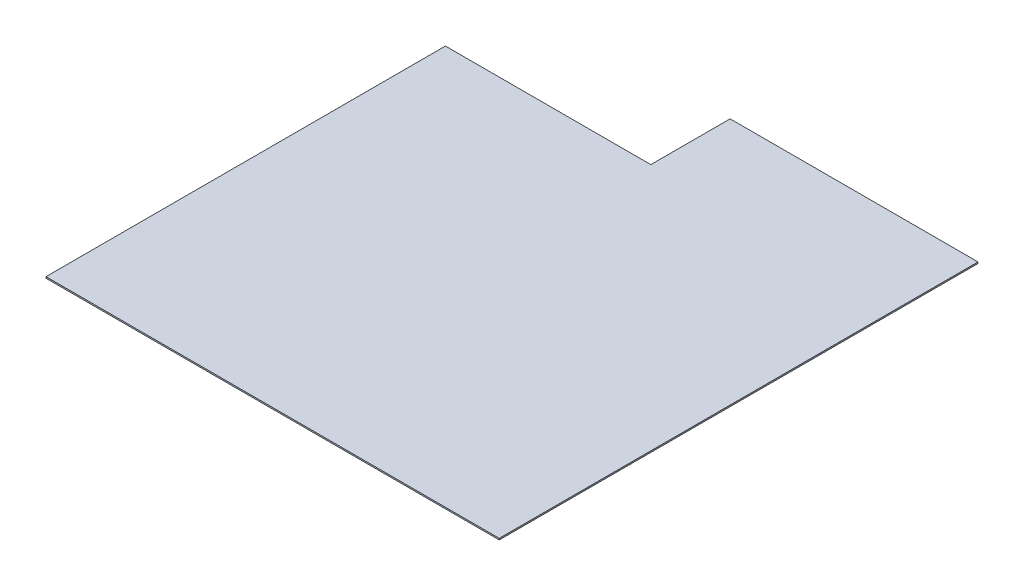
ISO-10303-21;
HEADER;
FILE_DESCRIPTION(('STEP AP214'),'2;1');
FILE_NAME('part.step','',(''),(''),'','','');
FILE_SCHEMA(('AUTOMOTIVE_DESIGN { 1 0 10303 214 1 1 1 1 }'));
ENDSEC;
DATA;
#1=APPLICATION_CONTEXT('core data for automotive mechanical design processes');
#2=APPLICATION_PROTOCOL_DEFINITION('international standard','automotive_design',2000,#1);
#3=PRODUCT_CONTEXT('',#1,'mechanical');
#4=PRODUCT('Part','Part','',(#3));
#5=PRODUCT_RELATED_PRODUCT_CATEGORY('part','',(#4));
#6=PRODUCT_DEFINITION_FORMATION('','',#4);
#7=PRODUCT_DEFINITION_CONTEXT('part definition',#1,'design');
#8=PRODUCT_DEFINITION('design','',#6,#7);
#9=PRODUCT_DEFINITION_SHAPE('','',#8);
#10=(LENGTH_UNIT() NAMED_UNIT(*) SI_UNIT(.MILLI.,.METRE.));
#11=(NAMED_UNIT(*) PLANE_ANGLE_UNIT() SI_UNIT($,.RADIAN.));
#12=(NAMED_UNIT(*) SI_UNIT($,.STERADIAN.) SOLID_ANGLE_UNIT());
#13=UNCERTAINTY_MEASURE_WITH_UNIT(LENGTH_MEASURE(1.E-05),#10,'distance_accuracy_value','');
#14=(GEOMETRIC_REPRESENTATION_CONTEXT(3) GLOBAL_UNCERTAINTY_ASSIGNED_CONTEXT((#13)) GLOBAL_UNIT_ASSIGNED_CONTEXT((#10,
#11,#12)) REPRESENTATION_CONTEXT('',''));
#15=CARTESIAN_POINT('',(0.,0.,0.));
#16=DIRECTION('',(0.,0.,1.));
#17=DIRECTION('',(1.,0.,0.));
#18=AXIS2_PLACEMENT_3D('',#15,#16,#17);
#19=CARTESIAN_POINT('',(-1016.,3.175,0.));
#20=DIRECTION('',(0.,0.,-1.));
#21=DIRECTION('',(-1.,0.,0.));
#22=AXIS2_PLACEMENT_3D('',#19,#20,#21);
#23=PLANE('',#22);
#24=DIRECTION('',(1.,0.,0.));
#25=VECTOR('',#24,1.);
#26=CARTESIAN_POINT('',(-1016.,0.,0.));
#27=LINE('',#26,#25);
#28=CARTESIAN_POINT('',(-1016.,0.,0.));
#29=VERTEX_POINT('',#28);
#30=CARTESIAN_POINT('',(0.,0.,0.));
#31=VERTEX_POINT('',#30);
#32=EDGE_CURVE('E116',#29,#31,#27,.T.);
#33=ORIENTED_EDGE('',*,*,#32,.T.);
#34=DIRECTION('',(0.,-1.,0.));
#35=VECTOR('',#34,1.);
#36=CARTESIAN_POINT('',(0.,3.175,0.));
#37=LINE('',#36,#35);
#38=CARTESIAN_POINT('',(0.,3.175,0.));
#39=VERTEX_POINT('',#38);
#40=EDGE_CURVE('E11',#39,#31,#37,.T.);
#41=ORIENTED_EDGE('',*,*,#40,.F.);
#42=DIRECTION('',(1.,0.,0.));
#43=VECTOR('',#42,1.);
#44=CARTESIAN_POINT('',(-1016.,3.175,0.));
#45=LINE('',#44,#43);
#46=CARTESIAN_POINT('',(-1016.,3.175,0.));
#47=VERTEX_POINT('',#46);
#48=EDGE_CURVE('E126',#47,#39,#45,.T.);
#49=ORIENTED_EDGE('',*,*,#48,.F.);
#50=DIRECTION('',(0.,-1.,0.));
#51=VECTOR('',#50,1.);
#52=CARTESIAN_POINT('',(-1016.,3.175,0.));
#53=LINE('',#52,#51);
#54=EDGE_CURVE('E112',#47,#29,#53,.T.);
#55=ORIENTED_EDGE('',*,*,#54,.T.);
#56=EDGE_LOOP('',(#33,#41,#49,#55));
#57=FACE_BOUND('',#56,.T.);
#58=ADVANCED_FACE('F32',(#57),#23,.F.);
#59=CARTESIAN_POINT('',(0.,3.175,0.));
#60=DIRECTION('',(-1.,0.,0.));
#61=DIRECTION('',(0.,0.,1.));
#62=AXIS2_PLACEMENT_3D('',#59,#60,#61);
#63=PLANE('',#62);
#64=DIRECTION('',(0.,0.,-1.));
#65=VECTOR('',#64,1.);
#66=CARTESIAN_POINT('',(0.,0.,0.));
#67=LINE('',#66,#65);
#68=CARTESIAN_POINT('',(0.,0.,-1073.15));
#69=VERTEX_POINT('',#68);
#70=EDGE_CURVE('E119',#31,#69,#67,.T.);
#71=ORIENTED_EDGE('',*,*,#70,.T.);
#72=DIRECTION('',(0.,-1.,0.));
#73=VECTOR('',#72,1.);
#74=CARTESIAN_POINT('',(0.,3.175,-1073.15));
#75=LINE('',#74,#73);
#76=CARTESIAN_POINT('',(0.,3.175,-1073.15));
#77=VERTEX_POINT('',#76);
#78=EDGE_CURVE('E40',#77,#69,#75,.T.);
#79=ORIENTED_EDGE('',*,*,#78,.F.);
#80=DIRECTION('',(0.,0.,-1.));
#81=VECTOR('',#80,1.);
#82=CARTESIAN_POINT('',(0.,3.175,0.));
#83=LINE('',#82,#81);
#84=EDGE_CURVE('E85',#39,#77,#83,.T.);
#85=ORIENTED_EDGE('',*,*,#84,.F.);
#86=ORIENTED_EDGE('',*,*,#40,.T.);
#87=EDGE_LOOP('',(#71,#79,#85,#86));
#88=FACE_BOUND('',#87,.T.);
#89=ADVANCED_FACE('F150',(#88),#63,.F.);
#90=CARTESIAN_POINT('',(0.,3.175,-1073.15));
#91=DIRECTION('',(0.,0.,1.));
#92=DIRECTION('',(1.,0.,0.));
#93=AXIS2_PLACEMENT_3D('',#90,#91,#92);
#94=PLANE('',#93);
#95=DIRECTION('',(-1.,0.,0.));
#96=VECTOR('',#95,1.);
#97=CARTESIAN_POINT('',(0.,0.,-1073.15));
#98=LINE('',#97,#96);
#99=CARTESIAN_POINT('',(-555.625,0.,-1073.15));
#100=VERTEX_POINT('',#99);
#101=EDGE_CURVE('E121',#69,#100,#98,.T.);
#102=ORIENTED_EDGE('',*,*,#101,.T.);
#103=DIRECTION('',(0.,-1.,0.));
#104=VECTOR('',#103,1.);
#105=CARTESIAN_POINT('',(-555.625,3.175,-1073.15));
#106=LINE('',#105,#104);
#107=CARTESIAN_POINT('',(-555.625,3.175,-1073.15));
#108=VERTEX_POINT('',#107);
#109=EDGE_CURVE('E107',#108,#100,#106,.T.);
#110=ORIENTED_EDGE('',*,*,#109,.F.);
#111=DIRECTION('',(-1.,0.,0.));
#112=VECTOR('',#111,1.);
#113=CARTESIAN_POINT('',(0.,3.175,-1073.15));
#114=LINE('',#113,#112);
#115=EDGE_CURVE('E98',#77,#108,#114,.T.);
#116=ORIENTED_EDGE('',*,*,#115,.F.);
#117=ORIENTED_EDGE('',*,*,#78,.T.);
#118=EDGE_LOOP('',(#102,#110,#116,#117));
#119=FACE_BOUND('',#118,.T.);
#120=ADVANCED_FACE('F132',(#119),#94,.F.);
#121=CARTESIAN_POINT('',(-555.625,3.175,-1073.15));
#122=DIRECTION('',(1.,0.,0.));
#123=DIRECTION('',(0.,0.,-1.));
#124=AXIS2_PLACEMENT_3D('',#121,#122,#123);
#125=PLANE('',#124);
#126=DIRECTION('',(0.,0.,1.));
#127=VECTOR('',#126,1.);
#128=CARTESIAN_POINT('',(-555.625,0.,-1073.15));
#129=LINE('',#128,#127);
#130=CARTESIAN_POINT('',(-555.625,0.,-895.35));
#131=VERTEX_POINT('',#130);
#132=EDGE_CURVE('E106',#100,#131,#129,.T.);
#133=ORIENTED_EDGE('',*,*,#132,.T.);
#134=DIRECTION('',(0.,-1.,0.));
#135=VECTOR('',#134,1.);
#136=CARTESIAN_POINT('',(-555.625,3.175,-895.35));
#137=LINE('',#136,#135);
#138=CARTESIAN_POINT('',(-555.625,3.175,-895.35));
#139=VERTEX_POINT('',#138);
#140=EDGE_CURVE('E103',#139,#131,#137,.T.);
#141=ORIENTED_EDGE('',*,*,#140,.F.);
#142=DIRECTION('',(0.,0.,1.));
#143=VECTOR('',#142,1.);
#144=CARTESIAN_POINT('',(-555.625,3.175,-1073.15));
#145=LINE('',#144,#143);
#146=EDGE_CURVE('E92',#108,#139,#145,.T.);
#147=ORIENTED_EDGE('',*,*,#146,.F.);
#148=ORIENTED_EDGE('',*,*,#109,.T.);
#149=EDGE_LOOP('',(#133,#141,#147,#148));
#150=FACE_BOUND('',#149,.T.);
#151=ADVANCED_FACE('F104',(#150),#125,.F.);
#152=CARTESIAN_POINT('',(-555.625,3.175,-895.35));
#153=DIRECTION('',(0.,0.,1.));
#154=DIRECTION('',(1.,0.,0.));
#155=AXIS2_PLACEMENT_3D('',#152,#153,#154);
#156=PLANE('',#155);
#157=DIRECTION('',(-1.,0.,0.));
#158=VECTOR('',#157,1.);
#159=CARTESIAN_POINT('',(-555.625,0.,-895.35));
#160=LINE('',#159,#158);
#161=CARTESIAN_POINT('',(-1016.,0.,-895.35));
#162=VERTEX_POINT('',#161);
#163=EDGE_CURVE('E71',#131,#162,#160,.T.);
#164=ORIENTED_EDGE('',*,*,#163,.T.);
#165=DIRECTION('',(0.,-1.,0.));
#166=VECTOR('',#165,1.);
#167=CARTESIAN_POINT('',(-1016.,3.175,-895.35));
#168=LINE('',#167,#166);
#169=CARTESIAN_POINT('',(-1016.,3.175,-895.35));
#170=VERTEX_POINT('',#169);
#171=EDGE_CURVE('E108',#170,#162,#168,.T.);
#172=ORIENTED_EDGE('',*,*,#171,.F.);
#173=DIRECTION('',(-1.,0.,0.));
#174=VECTOR('',#173,1.);
#175=CARTESIAN_POINT('',(-555.625,3.175,-895.35));
#176=LINE('',#175,#174);
#177=EDGE_CURVE('E96',#139,#170,#176,.T.);
#178=ORIENTED_EDGE('',*,*,#177,.F.);
#179=ORIENTED_EDGE('',*,*,#140,.T.);
#180=EDGE_LOOP('',(#164,#172,#178,#179));
#181=FACE_BOUND('',#180,.T.);
#182=ADVANCED_FACE('F110',(#181),#156,.F.);
#183=CARTESIAN_POINT('',(-1016.,3.175,-895.35));
#184=DIRECTION('',(1.,0.,0.));
#185=DIRECTION('',(0.,0.,-1.));
#186=AXIS2_PLACEMENT_3D('',#183,#184,#185);
#187=PLANE('',#186);
#188=DIRECTION('',(0.,0.,1.));
#189=VECTOR('',#188,1.);
#190=CARTESIAN_POINT('',(-1016.,0.,-895.35));
#191=LINE('',#190,#189);
#192=EDGE_CURVE('E77',#162,#29,#191,.T.);
#193=ORIENTED_EDGE('',*,*,#192,.T.);
#194=ORIENTED_EDGE('',*,*,#54,.F.);
#195=DIRECTION('',(0.,0.,1.));
#196=VECTOR('',#195,1.);
#197=CARTESIAN_POINT('',(-1016.,3.175,-895.35));
#198=LINE('',#197,#196);
#199=EDGE_CURVE('E48',#170,#47,#198,.T.);
#200=ORIENTED_EDGE('',*,*,#199,.F.);
#201=ORIENTED_EDGE('',*,*,#171,.T.);
#202=EDGE_LOOP('',(#193,#194,#200,#201));
#203=FACE_BOUND('',#202,.T.);
#204=ADVANCED_FACE('F139',(#203),#187,.F.);
#205=CARTESIAN_POINT('',(0.,3.175,0.));
#206=DIRECTION('',(0.,1.,0.));
#207=DIRECTION('',(0.,0.,1.));
#208=AXIS2_PLACEMENT_3D('',#205,#206,#207);
#209=PLANE('',#208);
#210=ORIENTED_EDGE('',*,*,#48,.T.);
#211=ORIENTED_EDGE('',*,*,#84,.T.);
#212=ORIENTED_EDGE('',*,*,#115,.T.);
#213=ORIENTED_EDGE('',*,*,#146,.T.);
#214=ORIENTED_EDGE('',*,*,#177,.T.);
#215=ORIENTED_EDGE('',*,*,#199,.T.);
#216=EDGE_LOOP('',(#210,#211,#212,#213,#214,#215));
#217=FACE_BOUND('',#216,.T.);
#218=ADVANCED_FACE('F94',(#217),#209,.T.);
#219=CARTESIAN_POINT('',(0.,0.,0.));
#220=DIRECTION('',(0.,1.,0.));
#221=DIRECTION('',(0.,0.,1.));
#222=AXIS2_PLACEMENT_3D('',#219,#220,#221);
#223=PLANE('',#222);
#224=ORIENTED_EDGE('',*,*,#32,.F.);
#225=ORIENTED_EDGE('',*,*,#192,.F.);
#226=ORIENTED_EDGE('',*,*,#163,.F.);
#227=ORIENTED_EDGE('',*,*,#132,.F.);
#228=ORIENTED_EDGE('',*,*,#101,.F.);
#229=ORIENTED_EDGE('',*,*,#70,.F.);
#230=EDGE_LOOP('',(#224,#225,#226,#227,#228,#229));
#231=FACE_BOUND('',#230,.T.);
#232=ADVANCED_FACE('F135',(#231),#223,.F.);
#233=CLOSED_SHELL('',(#58,#89,#120,#151,#182,#204,#218,#232));
#234=MANIFOLD_SOLID_BREP('B2',#233);
#235=ADVANCED_BREP_SHAPE_REPRESENTATION('',(#18,#234),#14);
#236=SHAPE_DEFINITION_REPRESENTATION(#9,#235);
ENDSEC;
END-ISO-10303-21;
